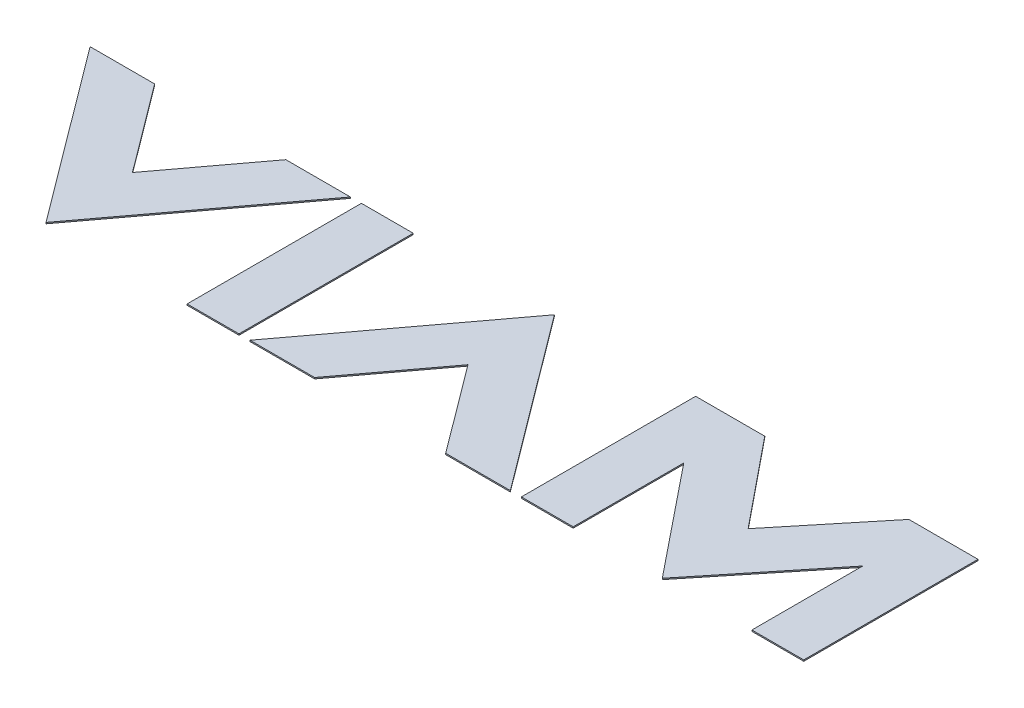
ISO-10303-21;
HEADER;
FILE_DESCRIPTION(('STEP AP214'),'2;1');
FILE_NAME('part.step','',(''),(''),'','','');
FILE_SCHEMA(('AUTOMOTIVE_DESIGN { 1 0 10303 214 1 1 1 1 }'));
ENDSEC;
DATA;
#1=APPLICATION_CONTEXT('core data for automotive mechanical design processes');
#2=APPLICATION_PROTOCOL_DEFINITION('international standard','automotive_design',2000,#1);
#3=PRODUCT_CONTEXT('',#1,'mechanical');
#4=PRODUCT('Part','Part','',(#3));
#5=PRODUCT_RELATED_PRODUCT_CATEGORY('part','',(#4));
#6=PRODUCT_DEFINITION_FORMATION('','',#4);
#7=PRODUCT_DEFINITION_CONTEXT('part definition',#1,'design');
#8=PRODUCT_DEFINITION('design','',#6,#7);
#9=PRODUCT_DEFINITION_SHAPE('','',#8);
#10=(LENGTH_UNIT() NAMED_UNIT(*) SI_UNIT(.MILLI.,.METRE.));
#11=(NAMED_UNIT(*) PLANE_ANGLE_UNIT() SI_UNIT($,.RADIAN.));
#12=(NAMED_UNIT(*) SI_UNIT($,.STERADIAN.) SOLID_ANGLE_UNIT());
#13=UNCERTAINTY_MEASURE_WITH_UNIT(LENGTH_MEASURE(1.E-05),#10,'distance_accuracy_value','');
#14=(GEOMETRIC_REPRESENTATION_CONTEXT(3) GLOBAL_UNCERTAINTY_ASSIGNED_CONTEXT((#13)) GLOBAL_UNIT_ASSIGNED_CONTEXT((#10,
#11,#12)) REPRESENTATION_CONTEXT('',''));
#15=CARTESIAN_POINT('',(0.,0.,0.));
#16=DIRECTION('',(0.,0.,1.));
#17=DIRECTION('',(1.,0.,0.));
#18=AXIS2_PLACEMENT_3D('',#15,#16,#17);
#19=CARTESIAN_POINT('',(11.7883153656796,0.1,6.73885035664306));
#20=DIRECTION('',(-0.801244842844147,0.,0.598336612464638));
#21=DIRECTION('',(0.598336612464638,0.,0.801244842844147));
#22=AXIS2_PLACEMENT_3D('',#19,#20,#21);
#23=PLANE('',#22);
#24=DIRECTION('',(-0.598336612464638,0.,-0.801244842844147));
#25=VECTOR('',#24,1.);
#26=CARTESIAN_POINT('',(11.7883153656796,0.,6.73885035664306));
#27=LINE('',#26,#25);
#28=CARTESIAN_POINT('',(11.7883153656796,0.,6.73885035664306));
#29=VERTEX_POINT('',#28);
#30=CARTESIAN_POINT('',(1.31660656567958,0.,-7.28402990335696));
#31=VERTEX_POINT('',#30);
#32=EDGE_CURVE('E150',#29,#31,#27,.T.);
#33=ORIENTED_EDGE('',*,*,#32,.T.);
#34=DIRECTION('',(0.,-1.,0.));
#35=VECTOR('',#34,1.);
#36=CARTESIAN_POINT('',(1.31660656567958,0.1,-7.28402990335696));
#37=LINE('',#36,#35);
#38=CARTESIAN_POINT('',(1.31660656567958,0.1,-7.28402990335696));
#39=VERTEX_POINT('',#38);
#40=EDGE_CURVE('E12',#39,#31,#37,.T.);
#41=ORIENTED_EDGE('',*,*,#40,.F.);
#42=DIRECTION('',(-0.598336612464638,0.,-0.801244842844147));
#43=VECTOR('',#42,1.);
#44=CARTESIAN_POINT('',(11.7883153656796,0.1,6.73885035664306));
#45=LINE('',#44,#43);
#46=CARTESIAN_POINT('',(11.7883153656796,0.1,6.73885035664306));
#47=VERTEX_POINT('',#46);
#48=EDGE_CURVE('E165',#47,#39,#45,.T.);
#49=ORIENTED_EDGE('',*,*,#48,.F.);
#50=DIRECTION('',(0.,-1.,0.));
#51=VECTOR('',#50,1.);
#52=CARTESIAN_POINT('',(11.7883153656796,0.1,6.73885035664306));
#53=LINE('',#52,#51);
#54=EDGE_CURVE('E146',#47,#29,#53,.T.);
#55=ORIENTED_EDGE('',*,*,#54,.T.);
#56=EDGE_LOOP('',(#33,#41,#49,#55));
#57=FACE_BOUND('',#56,.T.);
#58=ADVANCED_FACE('F50',(#57),#23,.F.);
#59=CARTESIAN_POINT('',(1.31660656567958,0.1,-7.28402990335696));
#60=DIRECTION('',(0.801160335078263,0.,0.598449761882553));
#61=DIRECTION('',(0.598449761882553,0.,-0.801160335078263));
#62=AXIS2_PLACEMENT_3D('',#59,#60,#61);
#63=PLANE('',#62);
#64=DIRECTION('',(-0.598449761882553,0.,0.801160335078263));
#65=VECTOR('',#64,1.);
#66=CARTESIAN_POINT('',(1.31660656567958,0.,-7.28402990335696));
#67=LINE('',#66,#65);
#68=CARTESIAN_POINT('',(-9.15510223432043,0.,6.73472031664306));
#69=VERTEX_POINT('',#68);
#70=EDGE_CURVE('E154',#31,#69,#67,.T.);
#71=ORIENTED_EDGE('',*,*,#70,.T.);
#72=DIRECTION('',(0.,-1.,0.));
#73=VECTOR('',#72,1.);
#74=CARTESIAN_POINT('',(-9.15510223432043,0.1,6.73472031664306));
#75=LINE('',#74,#73);
#76=CARTESIAN_POINT('',(-9.15510223432043,0.1,6.73472031664306));
#77=VERTEX_POINT('',#76);
#78=EDGE_CURVE('E59',#77,#69,#75,.T.);
#79=ORIENTED_EDGE('',*,*,#78,.F.);
#80=DIRECTION('',(-0.598449761882553,0.,0.801160335078263));
#81=VECTOR('',#80,1.);
#82=CARTESIAN_POINT('',(1.31660656567958,0.1,-7.28402990335696));
#83=LINE('',#82,#81);
#84=EDGE_CURVE('E111',#39,#77,#83,.T.);
#85=ORIENTED_EDGE('',*,*,#84,.F.);
#86=ORIENTED_EDGE('',*,*,#40,.T.);
#87=EDGE_LOOP('',(#71,#79,#85,#86));
#88=FACE_BOUND('',#87,.T.);
#89=ADVANCED_FACE('F193',(#88),#63,.F.);
#90=CARTESIAN_POINT('',(-9.15510223432043,0.1,6.73472031664306));
#91=DIRECTION('',(0.,0.,-1.));
#92=DIRECTION('',(-1.,0.,0.));
#93=AXIS2_PLACEMENT_3D('',#90,#91,#92);
#94=PLANE('',#93);
#95=DIRECTION('',(1.,0.,0.));
#96=VECTOR('',#95,1.);
#97=CARTESIAN_POINT('',(-9.15510223432043,0.,6.73472031664306));
#98=LINE('',#97,#96);
#99=CARTESIAN_POINT('',(-3.95856703432044,0.,6.73472031664306));
#100=VERTEX_POINT('',#99);
#101=EDGE_CURVE('E156',#69,#100,#98,.T.);
#102=ORIENTED_EDGE('',*,*,#101,.T.);
#103=DIRECTION('',(0.,-1.,0.));
#104=VECTOR('',#103,1.);
#105=CARTESIAN_POINT('',(-3.95856703432044,0.1,6.73472031664306));
#106=LINE('',#105,#104);
#107=CARTESIAN_POINT('',(-3.95856703432044,0.1,6.73472031664306));
#108=VERTEX_POINT('',#107);
#109=EDGE_CURVE('E138',#108,#100,#106,.T.);
#110=ORIENTED_EDGE('',*,*,#109,.F.);
#111=DIRECTION('',(1.,0.,0.));
#112=VECTOR('',#111,1.);
#113=CARTESIAN_POINT('',(-9.15510223432043,0.1,6.73472031664306));
#114=LINE('',#113,#112);
#115=EDGE_CURVE('E127',#77,#108,#114,.T.);
#116=ORIENTED_EDGE('',*,*,#115,.F.);
#117=ORIENTED_EDGE('',*,*,#78,.T.);
#118=EDGE_LOOP('',(#102,#110,#116,#117));
#119=FACE_BOUND('',#118,.T.);
#120=ADVANCED_FACE('F175',(#119),#94,.F.);
#121=CARTESIAN_POINT('',(-3.95856703432044,0.1,6.73472031664306));
#122=DIRECTION('',(-0.801122457843259,0.,-0.598500465780249));
#123=DIRECTION('',(-0.598500465780249,0.,0.801122457843259));
#124=AXIS2_PLACEMENT_3D('',#121,#122,#123);
#125=PLANE('',#124);
#126=DIRECTION('',(0.598500465780249,0.,-0.801122457843259));
#127=VECTOR('',#126,1.);
#128=CARTESIAN_POINT('',(-3.95856703432044,0.,6.73472031664306));
#129=LINE('',#128,#127);
#130=CARTESIAN_POINT('',(1.31660656567958,0.,-0.326360303356931));
#131=VERTEX_POINT('',#130);
#132=EDGE_CURVE('E136',#100,#131,#129,.T.);
#133=ORIENTED_EDGE('',*,*,#132,.T.);
#134=DIRECTION('',(0.,-1.,0.));
#135=VECTOR('',#134,1.);
#136=CARTESIAN_POINT('',(1.31660656567958,0.1,-0.326360303356931));
#137=LINE('',#136,#135);
#138=CARTESIAN_POINT('',(1.31660656567958,0.1,-0.326360303356931));
#139=VERTEX_POINT('',#138);
#140=EDGE_CURVE('E133',#139,#131,#137,.T.);
#141=ORIENTED_EDGE('',*,*,#140,.F.);
#142=DIRECTION('',(0.598500465780249,0.,-0.801122457843259));
#143=VECTOR('',#142,1.);
#144=CARTESIAN_POINT('',(-3.95856703432044,0.1,6.73472031664306));
#145=LINE('',#144,#143);
#146=EDGE_CURVE('E121',#108,#139,#145,.T.);
#147=ORIENTED_EDGE('',*,*,#146,.F.);
#148=ORIENTED_EDGE('',*,*,#109,.T.);
#149=EDGE_LOOP('',(#133,#141,#147,#148));
#150=FACE_BOUND('',#149,.T.);
#151=ADVANCED_FACE('F134',(#150),#125,.F.);
#152=CARTESIAN_POINT('',(1.31660656567958,0.1,-0.326360303356931));
#153=DIRECTION('',(0.801290209366539,0.,-0.598275856418532));
#154=DIRECTION('',(-0.598275856418532,0.,-0.801290209366539));
#155=AXIS2_PLACEMENT_3D('',#152,#153,#154);
#156=PLANE('',#155);
#157=DIRECTION('',(0.598275856418532,0.,0.801290209366539));
#158=VECTOR('',#157,1.);
#159=CARTESIAN_POINT('',(1.31660656567958,0.,-0.326360303356931));
#160=LINE('',#159,#158);
#161=CARTESIAN_POINT('',(6.59178016567957,0.,6.73885035664306));
#162=VERTEX_POINT('',#161);
#163=EDGE_CURVE('E97',#131,#162,#160,.T.);
#164=ORIENTED_EDGE('',*,*,#163,.T.);
#165=DIRECTION('',(0.,-1.,0.));
#166=VECTOR('',#165,1.);
#167=CARTESIAN_POINT('',(6.59178016567957,0.1,6.73885035664306));
#168=LINE('',#167,#166);
#169=CARTESIAN_POINT('',(6.59178016567957,0.1,6.73885035664306));
#170=VERTEX_POINT('',#169);
#171=EDGE_CURVE('E139',#170,#162,#168,.T.);
#172=ORIENTED_EDGE('',*,*,#171,.F.);
#173=DIRECTION('',(0.598275856418532,0.,0.801290209366539));
#174=VECTOR('',#173,1.);
#175=CARTESIAN_POINT('',(1.31660656567958,0.1,-0.326360303356931));
#176=LINE('',#175,#174);
#177=EDGE_CURVE('E125',#139,#170,#176,.T.);
#178=ORIENTED_EDGE('',*,*,#177,.F.);
#179=ORIENTED_EDGE('',*,*,#140,.T.);
#180=EDGE_LOOP('',(#164,#172,#178,#179));
#181=FACE_BOUND('',#180,.T.);
#182=ADVANCED_FACE('F141',(#181),#156,.F.);
#183=CARTESIAN_POINT('',(6.59178016567957,0.1,6.73885035664306));
#184=DIRECTION('',(0.,0.,-1.));
#185=DIRECTION('',(-1.,0.,0.));
#186=AXIS2_PLACEMENT_3D('',#183,#184,#185);
#187=PLANE('',#186);
#188=DIRECTION('',(1.,0.,0.));
#189=VECTOR('',#188,1.);
#190=CARTESIAN_POINT('',(6.59178016567957,0.,6.73885035664306));
#191=LINE('',#190,#189);
#192=EDGE_CURVE('E103',#162,#29,#191,.T.);
#193=ORIENTED_EDGE('',*,*,#192,.T.);
#194=ORIENTED_EDGE('',*,*,#54,.F.);
#195=DIRECTION('',(1.,0.,0.));
#196=VECTOR('',#195,1.);
#197=CARTESIAN_POINT('',(6.59178016567957,0.1,6.73885035664306));
#198=LINE('',#197,#196);
#199=EDGE_CURVE('E67',#170,#47,#198,.T.);
#200=ORIENTED_EDGE('',*,*,#199,.F.);
#201=ORIENTED_EDGE('',*,*,#171,.T.);
#202=EDGE_LOOP('',(#193,#194,#200,#201));
#203=FACE_BOUND('',#202,.T.);
#204=ADVANCED_FACE('F182',(#203),#187,.F.);
#205=CARTESIAN_POINT('',(0.,0.1,0.));
#206=DIRECTION('',(0.,-1.,0.));
#207=DIRECTION('',(0.,0.,-1.));
#208=AXIS2_PLACEMENT_3D('',#205,#206,#207);
#209=PLANE('',#208);
#210=ORIENTED_EDGE('',*,*,#48,.T.);
#211=ORIENTED_EDGE('',*,*,#84,.T.);
#212=ORIENTED_EDGE('',*,*,#115,.T.);
#213=ORIENTED_EDGE('',*,*,#146,.T.);
#214=ORIENTED_EDGE('',*,*,#177,.T.);
#215=ORIENTED_EDGE('',*,*,#199,.T.);
#216=EDGE_LOOP('',(#210,#211,#212,#213,#214,#215));
#217=FACE_BOUND('',#216,.T.);
#218=ADVANCED_FACE('F123',(#217),#209,.F.);
#219=CARTESIAN_POINT('',(0.,0.,0.));
#220=DIRECTION('',(0.,-1.,0.));
#221=DIRECTION('',(0.,0.,-1.));
#222=AXIS2_PLACEMENT_3D('',#219,#220,#221);
#223=PLANE('',#222);
#224=ORIENTED_EDGE('',*,*,#32,.F.);
#225=ORIENTED_EDGE('',*,*,#192,.F.);
#226=ORIENTED_EDGE('',*,*,#163,.F.);
#227=ORIENTED_EDGE('',*,*,#132,.F.);
#228=ORIENTED_EDGE('',*,*,#101,.F.);
#229=ORIENTED_EDGE('',*,*,#70,.F.);
#230=EDGE_LOOP('',(#224,#225,#226,#227,#228,#229));
#231=FACE_BOUND('',#230,.T.);
#232=ADVANCED_FACE('F178',(#231),#223,.T.);
#233=CLOSED_SHELL('',(#58,#89,#120,#151,#182,#204,#218,#232));
#234=MANIFOLD_SOLID_BREP('B2',#233);
#235=CARTESIAN_POINT('',(-15.0999214343204,0.1,-7.28402990335696));
#236=DIRECTION('',(0.,0.,1.));
#237=DIRECTION('',(1.,0.,0.));
#238=AXIS2_PLACEMENT_3D('',#235,#236,#237);
#239=PLANE('',#238);
#240=DIRECTION('',(-1.,0.,0.));
#241=VECTOR('',#240,1.);
#242=CARTESIAN_POINT('',(-15.0999214343204,0.,-7.28402990335696));
#243=LINE('',#242,#241);
#244=CARTESIAN_POINT('',(-15.0999214343204,0.,-7.28402990335696));
#245=VERTEX_POINT('',#244);
#246=CARTESIAN_POINT('',(-20.2966090343204,0.,-7.28402990335696));
#247=VERTEX_POINT('',#246);
#248=EDGE_CURVE('E350',#245,#247,#243,.T.);
#249=ORIENTED_EDGE('',*,*,#248,.T.);
#250=DIRECTION('',(0.,-1.,0.));
#251=VECTOR('',#250,1.);
#252=CARTESIAN_POINT('',(-20.2966090343204,0.1,-7.28402990335696));
#253=LINE('',#252,#251);
#254=CARTESIAN_POINT('',(-20.2966090343204,0.1,-7.28402990335696));
#255=VERTEX_POINT('',#254);
#256=EDGE_CURVE('E48',#255,#247,#253,.T.);
#257=ORIENTED_EDGE('',*,*,#256,.F.);
#258=DIRECTION('',(-1.,0.,0.));
#259=VECTOR('',#258,1.);
#260=CARTESIAN_POINT('',(-15.0999214343204,0.1,-7.28402990335696));
#261=LINE('',#260,#259);
#262=CARTESIAN_POINT('',(-15.0999214343204,0.1,-7.28402990335696));
#263=VERTEX_POINT('',#262);
#264=EDGE_CURVE('E360',#263,#255,#261,.T.);
#265=ORIENTED_EDGE('',*,*,#264,.F.);
#266=DIRECTION('',(0.,-1.,0.));
#267=VECTOR('',#266,1.);
#268=CARTESIAN_POINT('',(-15.0999214343204,0.1,-7.28402990335696));
#269=LINE('',#268,#267);
#270=EDGE_CURVE('E346',#263,#245,#269,.T.);
#271=ORIENTED_EDGE('',*,*,#270,.T.);
#272=EDGE_LOOP('',(#249,#257,#265,#271));
#273=FACE_BOUND('',#272,.T.);
#274=ADVANCED_FACE('F266',(#273),#239,.F.);
#275=CARTESIAN_POINT('',(-20.2966090343204,0.1,-7.28402990335696));
#276=DIRECTION('',(0.80129342434951,0.,0.598271550463697));
#277=DIRECTION('',(0.598271550463697,0.,-0.80129342434951));
#278=AXIS2_PLACEMENT_3D('',#275,#276,#277);
#279=PLANE('',#278);
#280=DIRECTION('',(-0.598271550463697,0.,0.80129342434951));
#281=VECTOR('',#280,1.);
#282=CARTESIAN_POINT('',(-20.2966090343204,0.,-7.28402990335696));
#283=LINE('',#282,#281);
#284=CARTESIAN_POINT('',(-25.5717064343204,0.,-0.218842103356952));
#285=VERTEX_POINT('',#284);
#286=EDGE_CURVE('E353',#247,#285,#283,.T.);
#287=ORIENTED_EDGE('',*,*,#286,.T.);
#288=DIRECTION('',(0.,-1.,0.));
#289=VECTOR('',#288,1.);
#290=CARTESIAN_POINT('',(-25.5717064343204,0.1,-0.218842103356952));
#291=LINE('',#290,#289);
#292=CARTESIAN_POINT('',(-25.5717064343204,0.1,-0.218842103356952));
#293=VERTEX_POINT('',#292);
#294=EDGE_CURVE('E274',#293,#285,#291,.T.);
#295=ORIENTED_EDGE('',*,*,#294,.F.);
#296=DIRECTION('',(-0.598271550463697,0.,0.80129342434951));
#297=VECTOR('',#296,1.);
#298=CARTESIAN_POINT('',(-20.2966090343204,0.1,-7.28402990335696));
#299=LINE('',#298,#297);
#300=EDGE_CURVE('E319',#255,#293,#299,.T.);
#301=ORIENTED_EDGE('',*,*,#300,.F.);
#302=ORIENTED_EDGE('',*,*,#256,.T.);
#303=EDGE_LOOP('',(#287,#295,#301,#302));
#304=FACE_BOUND('',#303,.T.);
#305=ADVANCED_FACE('F384',(#304),#279,.F.);
#306=CARTESIAN_POINT('',(-25.5717064343204,0.1,-0.218842103356952));
#307=DIRECTION('',(-0.801292181455901,0.,0.59827321512637));
#308=DIRECTION('',(0.59827321512637,0.,0.801292181455901));
#309=AXIS2_PLACEMENT_3D('',#306,#307,#308);
#310=PLANE('',#309);
#311=DIRECTION('',(-0.59827321512637,0.,-0.801292181455901));
#312=VECTOR('',#311,1.);
#313=CARTESIAN_POINT('',(-25.5717064343204,0.,-0.218842103356952));
#314=LINE('',#313,#312);
#315=CARTESIAN_POINT('',(-30.8468266943204,0.,-7.28402990335696));
#316=VERTEX_POINT('',#315);
#317=EDGE_CURVE('E355',#285,#316,#314,.T.);
#318=ORIENTED_EDGE('',*,*,#317,.T.);
#319=DIRECTION('',(0.,-1.,0.));
#320=VECTOR('',#319,1.);
#321=CARTESIAN_POINT('',(-30.8468266943204,0.1,-7.28402990335696));
#322=LINE('',#321,#320);
#323=CARTESIAN_POINT('',(-30.8468266943204,0.1,-7.28402990335696));
#324=VERTEX_POINT('',#323);
#325=EDGE_CURVE('E341',#324,#316,#322,.T.);
#326=ORIENTED_EDGE('',*,*,#325,.F.);
#327=DIRECTION('',(-0.59827321512637,0.,-0.801292181455901));
#328=VECTOR('',#327,1.);
#329=CARTESIAN_POINT('',(-25.5717064343204,0.1,-0.218842103356952));
#330=LINE('',#329,#328);
#331=EDGE_CURVE('E332',#293,#324,#330,.T.);
#332=ORIENTED_EDGE('',*,*,#331,.F.);
#333=ORIENTED_EDGE('',*,*,#294,.T.);
#334=EDGE_LOOP('',(#318,#326,#332,#333));
#335=FACE_BOUND('',#334,.T.);
#336=ADVANCED_FACE('F366',(#335),#310,.F.);
#337=CARTESIAN_POINT('',(-30.8468266943204,0.1,-7.28402990335696));
#338=DIRECTION('',(0.,0.,1.));
#339=DIRECTION('',(1.,0.,0.));
#340=AXIS2_PLACEMENT_3D('',#337,#338,#339);
#341=PLANE('',#340);
#342=DIRECTION('',(-1.,0.,0.));
#343=VECTOR('',#342,1.);
#344=CARTESIAN_POINT('',(-30.8468266943204,0.,-7.28402990335696));
#345=LINE('',#344,#343);
#346=CARTESIAN_POINT('',(-36.0434152343204,0.,-7.28402990335696));
#347=VERTEX_POINT('',#346);
#348=EDGE_CURVE('E340',#316,#347,#345,.T.);
#349=ORIENTED_EDGE('',*,*,#348,.T.);
#350=DIRECTION('',(0.,-1.,0.));
#351=VECTOR('',#350,1.);
#352=CARTESIAN_POINT('',(-36.0434152343204,0.1,-7.28402990335696));
#353=LINE('',#352,#351);
#354=CARTESIAN_POINT('',(-36.0434152343204,0.1,-7.28402990335696));
#355=VERTEX_POINT('',#354);
#356=EDGE_CURVE('E337',#355,#347,#353,.T.);
#357=ORIENTED_EDGE('',*,*,#356,.F.);
#358=DIRECTION('',(-1.,0.,0.));
#359=VECTOR('',#358,1.);
#360=CARTESIAN_POINT('',(-30.8468266943204,0.1,-7.28402990335696));
#361=LINE('',#360,#359);
#362=EDGE_CURVE('E326',#324,#355,#361,.T.);
#363=ORIENTED_EDGE('',*,*,#362,.F.);
#364=ORIENTED_EDGE('',*,*,#325,.T.);
#365=EDGE_LOOP('',(#349,#357,#363,#364));
#366=FACE_BOUND('',#365,.T.);
#367=ADVANCED_FACE('F338',(#366),#341,.F.);
#368=CARTESIAN_POINT('',(-36.0434152343204,0.1,-7.28402990335696));
#369=DIRECTION('',(0.801160335078263,0.,-0.598449761882553));
#370=DIRECTION('',(-0.598449761882553,0.,-0.801160335078263));
#371=AXIS2_PLACEMENT_3D('',#368,#369,#370);
#372=PLANE('',#371);
#373=DIRECTION('',(0.598449761882553,0.,0.801160335078263));
#374=VECTOR('',#373,1.);
#375=CARTESIAN_POINT('',(-36.0434152343204,0.,-7.28402990335696));
#376=LINE('',#375,#374);
#377=CARTESIAN_POINT('',(-25.5717064343204,0.,6.73472031664306));
#378=VERTEX_POINT('',#377);
#379=EDGE_CURVE('E305',#347,#378,#376,.T.);
#380=ORIENTED_EDGE('',*,*,#379,.T.);
#381=DIRECTION('',(0.,-1.,0.));
#382=VECTOR('',#381,1.);
#383=CARTESIAN_POINT('',(-25.5717064343204,0.1,6.73472031664306));
#384=LINE('',#383,#382);
#385=CARTESIAN_POINT('',(-25.5717064343204,0.1,6.73472031664306));
#386=VERTEX_POINT('',#385);
#387=EDGE_CURVE('E342',#386,#378,#384,.T.);
#388=ORIENTED_EDGE('',*,*,#387,.F.);
#389=DIRECTION('',(0.598449761882553,0.,0.801160335078263));
#390=VECTOR('',#389,1.);
#391=CARTESIAN_POINT('',(-36.0434152343204,0.1,-7.28402990335696));
#392=LINE('',#391,#390);
#393=EDGE_CURVE('E330',#355,#386,#392,.T.);
#394=ORIENTED_EDGE('',*,*,#393,.F.);
#395=ORIENTED_EDGE('',*,*,#356,.T.);
#396=EDGE_LOOP('',(#380,#388,#394,#395));
#397=FACE_BOUND('',#396,.T.);
#398=ADVANCED_FACE('F344',(#397),#372,.F.);
#399=CARTESIAN_POINT('',(-25.5717064343204,0.1,6.73472031664306));
#400=DIRECTION('',(-0.801158247166537,0.,-0.598452557014374));
#401=DIRECTION('',(-0.598452557014374,0.,0.801158247166537));
#402=AXIS2_PLACEMENT_3D('',#399,#400,#401);
#403=PLANE('',#402);
#404=DIRECTION('',(0.598452557014374,0.,-0.801158247166537));
#405=VECTOR('',#404,1.);
#406=CARTESIAN_POINT('',(-25.5717064343204,0.,6.73472031664306));
#407=LINE('',#406,#405);
#408=EDGE_CURVE('E311',#378,#245,#407,.T.);
#409=ORIENTED_EDGE('',*,*,#408,.T.);
#410=ORIENTED_EDGE('',*,*,#270,.F.);
#411=DIRECTION('',(0.598452557014374,0.,-0.801158247166537));
#412=VECTOR('',#411,1.);
#413=CARTESIAN_POINT('',(-25.5717064343204,0.1,6.73472031664306));
#414=LINE('',#413,#412);
#415=EDGE_CURVE('E282',#386,#263,#414,.T.);
#416=ORIENTED_EDGE('',*,*,#415,.F.);
#417=ORIENTED_EDGE('',*,*,#387,.T.);
#418=EDGE_LOOP('',(#409,#410,#416,#417));
#419=FACE_BOUND('',#418,.T.);
#420=ADVANCED_FACE('F373',(#419),#403,.F.);
#421=CARTESIAN_POINT('',(0.,0.1,0.));
#422=DIRECTION('',(0.,1.,0.));
#423=DIRECTION('',(0.,0.,1.));
#424=AXIS2_PLACEMENT_3D('',#421,#422,#423);
#425=PLANE('',#424);
#426=ORIENTED_EDGE('',*,*,#264,.T.);
#427=ORIENTED_EDGE('',*,*,#300,.T.);
#428=ORIENTED_EDGE('',*,*,#331,.T.);
#429=ORIENTED_EDGE('',*,*,#362,.T.);
#430=ORIENTED_EDGE('',*,*,#393,.T.);
#431=ORIENTED_EDGE('',*,*,#415,.T.);
#432=EDGE_LOOP('',(#426,#427,#428,#429,#430,#431));
#433=FACE_BOUND('',#432,.T.);
#434=ADVANCED_FACE('F328',(#433),#425,.T.);
#435=CARTESIAN_POINT('',(0.,0.,0.));
#436=DIRECTION('',(0.,1.,0.));
#437=DIRECTION('',(0.,0.,1.));
#438=AXIS2_PLACEMENT_3D('',#435,#436,#437);
#439=PLANE('',#438);
#440=ORIENTED_EDGE('',*,*,#248,.F.);
#441=ORIENTED_EDGE('',*,*,#408,.F.);
#442=ORIENTED_EDGE('',*,*,#379,.F.);
#443=ORIENTED_EDGE('',*,*,#348,.F.);
#444=ORIENTED_EDGE('',*,*,#317,.F.);
#445=ORIENTED_EDGE('',*,*,#286,.F.);
#446=EDGE_LOOP('',(#440,#441,#442,#443,#444,#445));
#447=FACE_BOUND('',#446,.T.);
#448=ADVANCED_FACE('F369',(#447),#439,.F.);
#449=CLOSED_SHELL('',(#274,#305,#336,#367,#398,#420,#434,#448));
#450=MANIFOLD_SOLID_BREP('B6',#449);
#451=CARTESIAN_POINT('',(35.3940847656796,0.1,-7.28402990335696));
#452=DIRECTION('',(0.,0.,1.));
#453=DIRECTION('',(1.,0.,0.));
#454=AXIS2_PLACEMENT_3D('',#451,#452,#453);
#455=PLANE('',#454);
#456=DIRECTION('',(-1.,0.,0.));
#457=VECTOR('',#456,1.);
#458=CARTESIAN_POINT('',(35.3940847656796,0.,-7.28402990335696));
#459=LINE('',#458,#457);
#460=CARTESIAN_POINT('',(35.3940847656796,0.,-7.28402990335696));
#461=VERTEX_POINT('',#460);
#462=CARTESIAN_POINT('',(29.8336945656796,0.,-7.28402990335696));
#463=VERTEX_POINT('',#462);
#464=EDGE_CURVE('E594',#461,#463,#459,.T.);
#465=ORIENTED_EDGE('',*,*,#464,.T.);
#466=DIRECTION('',(0.,-1.,0.));
#467=VECTOR('',#466,1.);
#468=CARTESIAN_POINT('',(29.8336945656796,0.1,-7.28402990335696));
#469=LINE('',#468,#467);
#470=CARTESIAN_POINT('',(29.8336945656796,0.1,-7.28402990335696));
#471=VERTEX_POINT('',#470);
#472=EDGE_CURVE('E264',#471,#463,#469,.T.);
#473=ORIENTED_EDGE('',*,*,#472,.F.);
#474=DIRECTION('',(-1.,0.,0.));
#475=VECTOR('',#474,1.);
#476=CARTESIAN_POINT('',(35.3940847656796,0.1,-7.28402990335696));
#477=LINE('',#476,#475);
#478=CARTESIAN_POINT('',(35.3940847656796,0.1,-7.28402990335696));
#479=VERTEX_POINT('',#478);
#480=EDGE_CURVE('E625',#479,#471,#477,.T.);
#481=ORIENTED_EDGE('',*,*,#480,.F.);
#482=DIRECTION('',(0.,-1.,0.));
#483=VECTOR('',#482,1.);
#484=CARTESIAN_POINT('',(35.3940847656796,0.1,-7.28402990335696));
#485=LINE('',#484,#483);
#486=EDGE_CURVE('E590',#479,#461,#485,.T.);
#487=ORIENTED_EDGE('',*,*,#486,.T.);
#488=EDGE_LOOP('',(#465,#473,#481,#487));
#489=FACE_BOUND('',#488,.T.);
#490=ADVANCED_FACE('F451',(#489),#455,.F.);
#491=CARTESIAN_POINT('',(29.8336945656796,0.1,-7.28402990335696));
#492=DIRECTION('',(0.773976134550616,0.,0.633214768578629));
#493=DIRECTION('',(0.633214768578629,0.,-0.773976134550616));
#494=AXIS2_PLACEMENT_3D('',#491,#492,#493);
#495=PLANE('',#494);
#496=DIRECTION('',(-0.633214768578629,0.,0.773976134550616));
#497=VECTOR('',#496,1.);
#498=CARTESIAN_POINT('',(29.8336945656796,0.,-7.28402990335696));
#499=LINE('',#498,#497);
#500=CARTESIAN_POINT('',(24.0128527656796,0.,-0.169235903356935));
#501=VERTEX_POINT('',#500);
#502=EDGE_CURVE('E598',#463,#501,#499,.T.);
#503=ORIENTED_EDGE('',*,*,#502,.T.);
#504=DIRECTION('',(0.,-1.,0.));
#505=VECTOR('',#504,1.);
#506=CARTESIAN_POINT('',(24.0128527656796,0.1,-0.169235903356935));
#507=LINE('',#506,#505);
#508=CARTESIAN_POINT('',(24.0128527656796,0.1,-0.169235903356935));
#509=VERTEX_POINT('',#508);
#510=EDGE_CURVE('E460',#509,#501,#507,.T.);
#511=ORIENTED_EDGE('',*,*,#510,.F.);
#512=DIRECTION('',(-0.633214768578629,0.,0.773976134550616));
#513=VECTOR('',#512,1.);
#514=CARTESIAN_POINT('',(29.8336945656796,0.1,-7.28402990335696));
#515=LINE('',#514,#513);
#516=EDGE_CURVE('E535',#471,#509,#515,.T.);
#517=ORIENTED_EDGE('',*,*,#516,.F.);
#518=ORIENTED_EDGE('',*,*,#472,.T.);
#519=EDGE_LOOP('',(#503,#511,#517,#518));
#520=FACE_BOUND('',#519,.T.);
#521=ADVANCED_FACE('F713',(#520),#495,.F.);
#522=CARTESIAN_POINT('',(24.0128527656796,0.1,-0.169235903356935));
#523=DIRECTION('',(-0.776407439323884,0.,0.630231297352432));
#524=DIRECTION('',(0.630231297352432,0.,0.776407439323884));
#525=AXIS2_PLACEMENT_3D('',#522,#523,#524);
#526=PLANE('',#525);
#527=DIRECTION('',(-0.630231297352432,0.,-0.776407439323884));
#528=VECTOR('',#527,1.);
#529=CARTESIAN_POINT('',(24.0128527656796,0.,-0.169235903356935));
#530=LINE('',#529,#528);
#531=CARTESIAN_POINT('',(18.2375785656796,0.,-7.28402990335696));
#532=VERTEX_POINT('',#531);
#533=EDGE_CURVE('E601',#501,#532,#530,.T.);
#534=ORIENTED_EDGE('',*,*,#533,.T.);
#535=DIRECTION('',(0.,-1.,0.));
#536=VECTOR('',#535,1.);
#537=CARTESIAN_POINT('',(18.2375785656796,0.1,-7.28402990335696));
#538=LINE('',#537,#536);
#539=CARTESIAN_POINT('',(18.2375785656796,0.1,-7.28402990335696));
#540=VERTEX_POINT('',#539);
#541=EDGE_CURVE('E647',#540,#532,#538,.T.);
#542=ORIENTED_EDGE('',*,*,#541,.F.);
#543=DIRECTION('',(-0.630231297352432,0.,-0.776407439323884));
#544=VECTOR('',#543,1.);
#545=CARTESIAN_POINT('',(24.0128527656796,0.1,-0.169235903356935));
#546=LINE('',#545,#544);
#547=EDGE_CURVE('E658',#509,#540,#546,.T.);
#548=ORIENTED_EDGE('',*,*,#547,.F.);
#549=ORIENTED_EDGE('',*,*,#510,.T.);
#550=EDGE_LOOP('',(#534,#542,#548,#549));
#551=FACE_BOUND('',#550,.T.);
#552=ADVANCED_FACE('F656',(#551),#526,.F.);
#553=CARTESIAN_POINT('',(18.2375785656796,0.1,-7.28402990335696));
#554=DIRECTION('',(0.,0.,1.));
#555=DIRECTION('',(1.,0.,0.));
#556=AXIS2_PLACEMENT_3D('',#553,#554,#555);
#557=PLANE('',#556);
#558=DIRECTION('',(-1.,0.,0.));
#559=VECTOR('',#558,1.);
#560=CARTESIAN_POINT('',(18.2375785656796,0.,-7.28402990335696));
#561=LINE('',#560,#559);
#562=CARTESIAN_POINT('',(12.6771883656796,0.,-7.28402990335696));
#563=VERTEX_POINT('',#562);
#564=EDGE_CURVE('E604',#532,#563,#561,.T.);
#565=ORIENTED_EDGE('',*,*,#564,.T.);
#566=DIRECTION('',(0.,-1.,0.));
#567=VECTOR('',#566,1.);
#568=CARTESIAN_POINT('',(12.6771883656796,0.1,-7.28402990335696));
#569=LINE('',#568,#567);
#570=CARTESIAN_POINT('',(12.6771883656796,0.1,-7.28402990335696));
#571=VERTEX_POINT('',#570);
#572=EDGE_CURVE('E644',#571,#563,#569,.T.);
#573=ORIENTED_EDGE('',*,*,#572,.F.);
#574=DIRECTION('',(-1.,0.,0.));
#575=VECTOR('',#574,1.);
#576=CARTESIAN_POINT('',(18.2375785656796,0.1,-7.28402990335696));
#577=LINE('',#576,#575);
#578=EDGE_CURVE('E676',#540,#571,#577,.T.);
#579=ORIENTED_EDGE('',*,*,#578,.F.);
#580=ORIENTED_EDGE('',*,*,#541,.T.);
#581=EDGE_LOOP('',(#565,#573,#579,#580));
#582=FACE_BOUND('',#581,.T.);
#583=ADVANCED_FACE('F667',(#582),#557,.F.);
#584=CARTESIAN_POINT('',(12.6771883656796,0.1,-7.28402990335696));
#585=DIRECTION('',(1.,0.,0.));
#586=DIRECTION('',(0.,0.,-1.));
#587=AXIS2_PLACEMENT_3D('',#584,#585,#586);
#588=PLANE('',#587);
#589=DIRECTION('',(0.,0.,1.));
#590=VECTOR('',#589,1.);
#591=CARTESIAN_POINT('',(12.6771883656796,0.,-7.28402990335696));
#592=LINE('',#591,#590);
#593=CARTESIAN_POINT('',(12.6771883656796,0.,6.73472031664306));
#594=VERTEX_POINT('',#593);
#595=EDGE_CURVE('E607',#563,#594,#592,.T.);
#596=ORIENTED_EDGE('',*,*,#595,.T.);
#597=DIRECTION('',(0.,-1.,0.));
#598=VECTOR('',#597,1.);
#599=CARTESIAN_POINT('',(12.6771883656796,0.1,6.73472031664306));
#600=LINE('',#599,#598);
#601=CARTESIAN_POINT('',(12.6771883656796,0.1,6.73472031664306));
#602=VERTEX_POINT('',#601);
#603=EDGE_CURVE('E641',#602,#594,#600,.T.);
#604=ORIENTED_EDGE('',*,*,#603,.F.);
#605=DIRECTION('',(0.,0.,1.));
#606=VECTOR('',#605,1.);
#607=CARTESIAN_POINT('',(12.6771883656796,0.1,-7.28402990335696));
#608=LINE('',#607,#606);
#609=EDGE_CURVE('E673',#571,#602,#608,.T.);
#610=ORIENTED_EDGE('',*,*,#609,.F.);
#611=ORIENTED_EDGE('',*,*,#572,.T.);
#612=EDGE_LOOP('',(#596,#604,#610,#611));
#613=FACE_BOUND('',#612,.T.);
#614=ADVANCED_FACE('F671',(#613),#588,.F.);
#615=CARTESIAN_POINT('',(12.6771883656796,0.1,6.73472031664306));
#616=DIRECTION('',(0.,0.,-1.));
#617=DIRECTION('',(-1.,0.,0.));
#618=AXIS2_PLACEMENT_3D('',#615,#616,#617);
#619=PLANE('',#618);
#620=DIRECTION('',(1.,0.,0.));
#621=VECTOR('',#620,1.);
#622=CARTESIAN_POINT('',(12.6771883656796,0.,6.73472031664306));
#623=LINE('',#622,#621);
#624=CARTESIAN_POINT('',(16.8443377656796,0.,6.73472031664306));
#625=VERTEX_POINT('',#624);
#626=EDGE_CURVE('E609',#594,#625,#623,.T.);
#627=ORIENTED_EDGE('',*,*,#626,.T.);
#628=DIRECTION('',(0.,-1.,0.));
#629=VECTOR('',#628,1.);
#630=CARTESIAN_POINT('',(16.8443377656796,0.1,6.73472031664306));
#631=LINE('',#630,#629);
#632=CARTESIAN_POINT('',(16.8443377656796,0.1,6.73472031664306));
#633=VERTEX_POINT('',#632);
#634=EDGE_CURVE('E638',#633,#625,#631,.T.);
#635=ORIENTED_EDGE('',*,*,#634,.F.);
#636=DIRECTION('',(1.,0.,0.));
#637=VECTOR('',#636,1.);
#638=CARTESIAN_POINT('',(12.6771883656796,0.1,6.73472031664306));
#639=LINE('',#638,#637);
#640=EDGE_CURVE('E675',#602,#633,#639,.T.);
#641=ORIENTED_EDGE('',*,*,#640,.F.);
#642=ORIENTED_EDGE('',*,*,#603,.T.);
#643=EDGE_LOOP('',(#627,#635,#641,#642));
#644=FACE_BOUND('',#643,.T.);
#645=ADVANCED_FACE('F726',(#644),#619,.F.);
#646=CARTESIAN_POINT('',(16.8443377656796,0.1,6.73472031664306));
#647=DIRECTION('',(-1.,0.,0.));
#648=DIRECTION('',(0.,0.,1.));
#649=AXIS2_PLACEMENT_3D('',#646,#647,#648);
#650=PLANE('',#649);
#651=DIRECTION('',(0.,0.,-1.));
#652=VECTOR('',#651,1.);
#653=CARTESIAN_POINT('',(16.8443377656796,0.,6.73472031664306));
#654=LINE('',#653,#652);
#655=CARTESIAN_POINT('',(16.8443377656796,0.,-2.16186590335696));
#656=VERTEX_POINT('',#655);
#657=EDGE_CURVE('E611',#625,#656,#654,.T.);
#658=ORIENTED_EDGE('',*,*,#657,.T.);
#659=DIRECTION('',(0.,-1.,0.));
#660=VECTOR('',#659,1.);
#661=CARTESIAN_POINT('',(16.8443377656796,0.1,-2.16186590335696));
#662=LINE('',#661,#660);
#663=CARTESIAN_POINT('',(16.8443377656796,0.1,-2.16186590335696));
#664=VERTEX_POINT('',#663);
#665=EDGE_CURVE('E634',#664,#656,#662,.T.);
#666=ORIENTED_EDGE('',*,*,#665,.F.);
#667=DIRECTION('',(0.,0.,-1.));
#668=VECTOR('',#667,1.);
#669=CARTESIAN_POINT('',(16.8443377656796,0.1,6.73472031664306));
#670=LINE('',#669,#668);
#671=EDGE_CURVE('E678',#633,#664,#670,.T.);
#672=ORIENTED_EDGE('',*,*,#671,.F.);
#673=ORIENTED_EDGE('',*,*,#634,.T.);
#674=EDGE_LOOP('',(#658,#666,#672,#673));
#675=FACE_BOUND('',#674,.T.);
#676=ADVANCED_FACE('F729',(#675),#650,.F.);
#677=CARTESIAN_POINT('',(16.8443377656796,0.1,-2.16186590335696));
#678=DIRECTION('',(0.778676058069398,0.,-0.627426168237748));
#679=DIRECTION('',(-0.627426168237748,0.,-0.778676058069398));
#680=AXIS2_PLACEMENT_3D('',#677,#678,#679);
#681=PLANE('',#680);
#682=DIRECTION('',(0.627426168237748,0.,0.778676058069398));
#683=VECTOR('',#682,1.);
#684=CARTESIAN_POINT('',(16.8443377656796,0.,-2.16186590335696));
#685=LINE('',#684,#683);
#686=CARTESIAN_POINT('',(24.0128527656796,0.,6.73472031664306));
#687=VERTEX_POINT('',#686);
#688=EDGE_CURVE('E614',#656,#687,#685,.T.);
#689=ORIENTED_EDGE('',*,*,#688,.T.);
#690=DIRECTION('',(0.,-1.,0.));
#691=VECTOR('',#690,1.);
#692=CARTESIAN_POINT('',(24.0128527656796,0.1,6.73472031664306));
#693=LINE('',#692,#691);
#694=CARTESIAN_POINT('',(24.0128527656796,0.1,6.73472031664306));
#695=VERTEX_POINT('',#694);
#696=EDGE_CURVE('E630',#695,#687,#693,.T.);
#697=ORIENTED_EDGE('',*,*,#696,.F.);
#698=DIRECTION('',(0.627426168237748,0.,0.778676058069398));
#699=VECTOR('',#698,1.);
#700=CARTESIAN_POINT('',(16.8443377656796,0.1,-2.16186590335696));
#701=LINE('',#700,#699);
#702=EDGE_CURVE('E686',#664,#695,#701,.T.);
#703=ORIENTED_EDGE('',*,*,#702,.F.);
#704=ORIENTED_EDGE('',*,*,#665,.T.);
#705=EDGE_LOOP('',(#689,#697,#703,#704));
#706=FACE_BOUND('',#705,.T.);
#707=ADVANCED_FACE('F694',(#706),#681,.F.);
#708=CARTESIAN_POINT('',(24.0128527656796,0.1,6.73472031664306));
#709=DIRECTION('',(-0.777623653734688,0.,-0.62873003201081));
#710=DIRECTION('',(-0.62873003201081,0.,0.777623653734688));
#711=AXIS2_PLACEMENT_3D('',#708,#709,#710);
#712=PLANE('',#711);
#713=DIRECTION('',(0.62873003201081,0.,-0.777623653734688));
#714=VECTOR('',#713,1.);
#715=CARTESIAN_POINT('',(24.0128527656796,0.,6.73472031664306));
#716=LINE('',#715,#714);
#717=CARTESIAN_POINT('',(31.2227443656796,0.,-2.18259230335694));
#718=VERTEX_POINT('',#717);
#719=EDGE_CURVE('E617',#687,#718,#716,.T.);
#720=ORIENTED_EDGE('',*,*,#719,.T.);
#721=DIRECTION('',(0.,-1.,0.));
#722=VECTOR('',#721,1.);
#723=CARTESIAN_POINT('',(31.2227443656796,0.1,-2.18259230335694));
#724=LINE('',#723,#722);
#725=CARTESIAN_POINT('',(31.2227443656796,0.1,-2.18259230335694));
#726=VERTEX_POINT('',#725);
#727=EDGE_CURVE('E581',#726,#718,#724,.T.);
#728=ORIENTED_EDGE('',*,*,#727,.F.);
#729=DIRECTION('',(0.62873003201081,0.,-0.777623653734688));
#730=VECTOR('',#729,1.);
#731=CARTESIAN_POINT('',(24.0128527656796,0.1,6.73472031664306));
#732=LINE('',#731,#730);
#733=EDGE_CURVE('E570',#695,#726,#732,.T.);
#734=ORIENTED_EDGE('',*,*,#733,.F.);
#735=ORIENTED_EDGE('',*,*,#696,.T.);
#736=EDGE_LOOP('',(#720,#728,#734,#735));
#737=FACE_BOUND('',#736,.T.);
#738=ADVANCED_FACE('F698',(#737),#712,.F.);
#739=CARTESIAN_POINT('',(31.2227443656796,0.1,-2.18259230335694));
#740=DIRECTION('',(1.,0.,0.));
#741=DIRECTION('',(0.,0.,-1.));
#742=AXIS2_PLACEMENT_3D('',#739,#740,#741);
#743=PLANE('',#742);
#744=DIRECTION('',(0.,0.,1.));
#745=VECTOR('',#744,1.);
#746=CARTESIAN_POINT('',(31.2227443656796,0.,-2.18259230335694));
#747=LINE('',#746,#745);
#748=CARTESIAN_POINT('',(31.2227443656796,0.,6.73472031664306));
#749=VERTEX_POINT('',#748);
#750=EDGE_CURVE('E579',#718,#749,#747,.T.);
#751=ORIENTED_EDGE('',*,*,#750,.T.);
#752=DIRECTION('',(0.,-1.,0.));
#753=VECTOR('',#752,1.);
#754=CARTESIAN_POINT('',(31.2227443656796,0.1,6.73472031664306));
#755=LINE('',#754,#753);
#756=CARTESIAN_POINT('',(31.2227443656796,0.1,6.73472031664306));
#757=VERTEX_POINT('',#756);
#758=EDGE_CURVE('E576',#757,#749,#755,.T.);
#759=ORIENTED_EDGE('',*,*,#758,.F.);
#760=DIRECTION('',(0.,0.,1.));
#761=VECTOR('',#760,1.);
#762=CARTESIAN_POINT('',(31.2227443656796,0.1,-2.18259230335694));
#763=LINE('',#762,#761);
#764=EDGE_CURVE('E564',#726,#757,#763,.T.);
#765=ORIENTED_EDGE('',*,*,#764,.F.);
#766=ORIENTED_EDGE('',*,*,#727,.T.);
#767=EDGE_LOOP('',(#751,#759,#765,#766));
#768=FACE_BOUND('',#767,.T.);
#769=ADVANCED_FACE('F577',(#768),#743,.F.);
#770=CARTESIAN_POINT('',(31.2227443656796,0.1,6.73472031664306));
#771=DIRECTION('',(0.,0.,-1.));
#772=DIRECTION('',(-1.,0.,0.));
#773=AXIS2_PLACEMENT_3D('',#770,#771,#772);
#774=PLANE('',#773);
#775=DIRECTION('',(1.,0.,0.));
#776=VECTOR('',#775,1.);
#777=CARTESIAN_POINT('',(31.2227443656796,0.,6.73472031664306));
#778=LINE('',#777,#776);
#779=CARTESIAN_POINT('',(35.3940847656796,0.,6.73472031664306));
#780=VERTEX_POINT('',#779);
#781=EDGE_CURVE('E519',#749,#780,#778,.T.);
#782=ORIENTED_EDGE('',*,*,#781,.T.);
#783=DIRECTION('',(0.,-1.,0.));
#784=VECTOR('',#783,1.);
#785=CARTESIAN_POINT('',(35.3940847656796,0.1,6.73472031664306));
#786=LINE('',#785,#784);
#787=CARTESIAN_POINT('',(35.3940847656796,0.1,6.73472031664306));
#788=VERTEX_POINT('',#787);
#789=EDGE_CURVE('E582',#788,#780,#786,.T.);
#790=ORIENTED_EDGE('',*,*,#789,.F.);
#791=DIRECTION('',(1.,0.,0.));
#792=VECTOR('',#791,1.);
#793=CARTESIAN_POINT('',(31.2227443656796,0.1,6.73472031664306));
#794=LINE('',#793,#792);
#795=EDGE_CURVE('E568',#757,#788,#794,.T.);
#796=ORIENTED_EDGE('',*,*,#795,.F.);
#797=ORIENTED_EDGE('',*,*,#758,.T.);
#798=EDGE_LOOP('',(#782,#790,#796,#797));
#799=FACE_BOUND('',#798,.T.);
#800=ADVANCED_FACE('F584',(#799),#774,.F.);
#801=CARTESIAN_POINT('',(35.3940847656796,0.1,6.73472031664306));
#802=DIRECTION('',(-1.,0.,0.));
#803=DIRECTION('',(0.,0.,1.));
#804=AXIS2_PLACEMENT_3D('',#801,#802,#803);
#805=PLANE('',#804);
#806=DIRECTION('',(0.,0.,-1.));
#807=VECTOR('',#806,1.);
#808=CARTESIAN_POINT('',(35.3940847656796,0.,6.73472031664306));
#809=LINE('',#808,#807);
#810=EDGE_CURVE('E525',#780,#461,#809,.T.);
#811=ORIENTED_EDGE('',*,*,#810,.T.);
#812=ORIENTED_EDGE('',*,*,#486,.F.);
#813=DIRECTION('',(0.,0.,-1.));
#814=VECTOR('',#813,1.);
#815=CARTESIAN_POINT('',(35.3940847656796,0.1,6.73472031664306));
#816=LINE('',#815,#814);
#817=EDGE_CURVE('E468',#788,#479,#816,.T.);
#818=ORIENTED_EDGE('',*,*,#817,.F.);
#819=ORIENTED_EDGE('',*,*,#789,.T.);
#820=EDGE_LOOP('',(#811,#812,#818,#819));
#821=FACE_BOUND('',#820,.T.);
#822=ADVANCED_FACE('F702',(#821),#805,.F.);
#823=CARTESIAN_POINT('',(0.,0.1,0.));
#824=DIRECTION('',(0.,1.,0.));
#825=DIRECTION('',(0.,0.,1.));
#826=AXIS2_PLACEMENT_3D('',#823,#824,#825);
#827=PLANE('',#826);
#828=ORIENTED_EDGE('',*,*,#480,.T.);
#829=ORIENTED_EDGE('',*,*,#516,.T.);
#830=ORIENTED_EDGE('',*,*,#547,.T.);
#831=ORIENTED_EDGE('',*,*,#578,.T.);
#832=ORIENTED_EDGE('',*,*,#609,.T.);
#833=ORIENTED_EDGE('',*,*,#640,.T.);
#834=ORIENTED_EDGE('',*,*,#671,.T.);
#835=ORIENTED_EDGE('',*,*,#702,.T.);
#836=ORIENTED_EDGE('',*,*,#733,.T.);
#837=ORIENTED_EDGE('',*,*,#764,.T.);
#838=ORIENTED_EDGE('',*,*,#795,.T.);
#839=ORIENTED_EDGE('',*,*,#817,.T.);
#840=EDGE_LOOP('',(#828,#829,#830,#831,#832,#833,#834,#835,#836,#837,#838,#839));
#841=FACE_BOUND('',#840,.T.);
#842=ADVANCED_FACE('F566',(#841),#827,.T.);
#843=CARTESIAN_POINT('',(0.,0.,0.));
#844=DIRECTION('',(0.,1.,0.));
#845=DIRECTION('',(0.,0.,1.));
#846=AXIS2_PLACEMENT_3D('',#843,#844,#845);
#847=PLANE('',#846);
#848=ORIENTED_EDGE('',*,*,#464,.F.);
#849=ORIENTED_EDGE('',*,*,#810,.F.);
#850=ORIENTED_EDGE('',*,*,#781,.F.);
#851=ORIENTED_EDGE('',*,*,#750,.F.);
#852=ORIENTED_EDGE('',*,*,#719,.F.);
#853=ORIENTED_EDGE('',*,*,#688,.F.);
#854=ORIENTED_EDGE('',*,*,#657,.F.);
#855=ORIENTED_EDGE('',*,*,#626,.F.);
#856=ORIENTED_EDGE('',*,*,#595,.F.);
#857=ORIENTED_EDGE('',*,*,#564,.F.);
#858=ORIENTED_EDGE('',*,*,#533,.F.);
#859=ORIENTED_EDGE('',*,*,#502,.F.);
#860=EDGE_LOOP('',(#848,#849,#850,#851,#852,#853,#854,#855,#856,#857,#858,#859));
#861=FACE_BOUND('',#860,.T.);
#862=ADVANCED_FACE('F662',(#861),#847,.F.);
#863=CLOSED_SHELL('',(#490,#521,#552,#583,#614,#645,#676,#707,#738,#769,#800,#822,#842,#862));
#864=MANIFOLD_SOLID_BREP('B42',#863);
#865=CARTESIAN_POINT('',(-14.2153156343204,0.1,6.73472031664306));
#866=DIRECTION('',(1.,0.,0.));
#867=DIRECTION('',(0.,0.,-1.));
#868=AXIS2_PLACEMENT_3D('',#865,#866,#867);
#869=PLANE('',#868);
#870=DIRECTION('',(0.,0.,1.));
#871=VECTOR('',#870,1.);
#872=CARTESIAN_POINT('',(-14.2153156343204,0.,6.73472031664306));
#873=LINE('',#872,#871);
#874=CARTESIAN_POINT('',(-14.2153156343204,0.,-7.28402990335696));
#875=VERTEX_POINT('',#874);
#876=CARTESIAN_POINT('',(-14.2153156343204,0.,6.73472031664306));
#877=VERTEX_POINT('',#876);
#878=EDGE_CURVE('E892',#875,#877,#873,.T.);
#879=ORIENTED_EDGE('',*,*,#878,.T.);
#880=DIRECTION('',(0.,-1.,0.));
#881=VECTOR('',#880,1.);
#882=CARTESIAN_POINT('',(-14.2153156343204,0.1,6.73472031664306));
#883=LINE('',#882,#881);
#884=CARTESIAN_POINT('',(-14.2153156343204,0.1,6.73472031664306));
#885=VERTEX_POINT('',#884);
#886=EDGE_CURVE('E449',#885,#877,#883,.T.);
#887=ORIENTED_EDGE('',*,*,#886,.F.);
#888=DIRECTION('',(0.,0.,1.));
#889=VECTOR('',#888,1.);
#890=CARTESIAN_POINT('',(-14.2153156343204,0.1,6.73472031664306));
#891=LINE('',#890,#889);
#892=CARTESIAN_POINT('',(-14.2153156343204,0.1,-7.28402990335696));
#893=VERTEX_POINT('',#892);
#894=EDGE_CURVE('E880',#893,#885,#891,.T.);
#895=ORIENTED_EDGE('',*,*,#894,.F.);
#896=DIRECTION('',(0.,-1.,0.));
#897=VECTOR('',#896,1.);
#898=CARTESIAN_POINT('',(-14.2153156343204,0.1,-7.28402990335696));
#899=LINE('',#898,#897);
#900=EDGE_CURVE('E888',#893,#875,#899,.T.);
#901=ORIENTED_EDGE('',*,*,#900,.T.);
#902=EDGE_LOOP('',(#879,#887,#895,#901));
#903=FACE_BOUND('',#902,.T.);
#904=ADVANCED_FACE('F829',(#903),#869,.F.);
#905=CARTESIAN_POINT('',(-10.0439752343204,0.1,6.73472031664306));
#906=DIRECTION('',(0.,0.,-1.));
#907=DIRECTION('',(-1.,0.,0.));
#908=AXIS2_PLACEMENT_3D('',#905,#906,#907);
#909=PLANE('',#908);
#910=DIRECTION('',(1.,0.,0.));
#911=VECTOR('',#910,1.);
#912=CARTESIAN_POINT('',(-10.0439752343204,0.,6.73472031664306));
#913=LINE('',#912,#911);
#914=CARTESIAN_POINT('',(-10.0439752343204,0.,6.73472031664306));
#915=VERTEX_POINT('',#914);
#916=EDGE_CURVE('E884',#877,#915,#913,.T.);
#917=ORIENTED_EDGE('',*,*,#916,.T.);
#918=DIRECTION('',(0.,-1.,0.));
#919=VECTOR('',#918,1.);
#920=CARTESIAN_POINT('',(-10.0439752343204,0.1,6.73472031664306));
#921=LINE('',#920,#919);
#922=CARTESIAN_POINT('',(-10.0439752343204,0.1,6.73472031664306));
#923=VERTEX_POINT('',#922);
#924=EDGE_CURVE('E837',#923,#915,#921,.T.);
#925=ORIENTED_EDGE('',*,*,#924,.F.);
#926=DIRECTION('',(1.,0.,0.));
#927=VECTOR('',#926,1.);
#928=CARTESIAN_POINT('',(-10.0439752343204,0.1,6.73472031664306));
#929=LINE('',#928,#927);
#930=EDGE_CURVE('E875',#885,#923,#929,.T.);
#931=ORIENTED_EDGE('',*,*,#930,.F.);
#932=ORIENTED_EDGE('',*,*,#886,.T.);
#933=EDGE_LOOP('',(#917,#925,#931,#932));
#934=FACE_BOUND('',#933,.T.);
#935=ADVANCED_FACE('F883',(#934),#909,.F.);
#936=CARTESIAN_POINT('',(-10.0439752343204,0.1,-7.28402990335696));
#937=DIRECTION('',(-1.,0.,0.));
#938=DIRECTION('',(0.,0.,1.));
#939=AXIS2_PLACEMENT_3D('',#936,#937,#938);
#940=PLANE('',#939);
#941=DIRECTION('',(0.,0.,-1.));
#942=VECTOR('',#941,1.);
#943=CARTESIAN_POINT('',(-10.0439752343204,0.,-7.28402990335696));
#944=LINE('',#943,#942);
#945=CARTESIAN_POINT('',(-10.0439752343204,0.,-7.28402990335696));
#946=VERTEX_POINT('',#945);
#947=EDGE_CURVE('E862',#915,#946,#944,.T.);
#948=ORIENTED_EDGE('',*,*,#947,.T.);
#949=DIRECTION('',(0.,-1.,0.));
#950=VECTOR('',#949,1.);
#951=CARTESIAN_POINT('',(-10.0439752343204,0.1,-7.28402990335696));
#952=LINE('',#951,#950);
#953=CARTESIAN_POINT('',(-10.0439752343204,0.1,-7.28402990335696));
#954=VERTEX_POINT('',#953);
#955=EDGE_CURVE('E885',#954,#946,#952,.T.);
#956=ORIENTED_EDGE('',*,*,#955,.F.);
#957=DIRECTION('',(0.,0.,-1.));
#958=VECTOR('',#957,1.);
#959=CARTESIAN_POINT('',(-10.0439752343204,0.1,-7.28402990335696));
#960=LINE('',#959,#958);
#961=EDGE_CURVE('E878',#923,#954,#960,.T.);
#962=ORIENTED_EDGE('',*,*,#961,.F.);
#963=ORIENTED_EDGE('',*,*,#924,.T.);
#964=EDGE_LOOP('',(#948,#956,#962,#963));
#965=FACE_BOUND('',#964,.T.);
#966=ADVANCED_FACE('F886',(#965),#940,.F.);
#967=CARTESIAN_POINT('',(-14.2153156343204,0.1,-7.28402990335696));
#968=DIRECTION('',(0.,0.,1.));
#969=DIRECTION('',(1.,0.,0.));
#970=AXIS2_PLACEMENT_3D('',#967,#968,#969);
#971=PLANE('',#970);
#972=DIRECTION('',(-1.,0.,0.));
#973=VECTOR('',#972,1.);
#974=CARTESIAN_POINT('',(-14.2153156343204,0.,-7.28402990335696));
#975=LINE('',#974,#973);
#976=EDGE_CURVE('E868',#946,#875,#975,.T.);
#977=ORIENTED_EDGE('',*,*,#976,.T.);
#978=ORIENTED_EDGE('',*,*,#900,.F.);
#979=DIRECTION('',(-1.,0.,0.));
#980=VECTOR('',#979,1.);
#981=CARTESIAN_POINT('',(-14.2153156343204,0.1,-7.28402990335696));
#982=LINE('',#981,#980);
#983=EDGE_CURVE('E845',#954,#893,#982,.T.);
#984=ORIENTED_EDGE('',*,*,#983,.F.);
#985=ORIENTED_EDGE('',*,*,#955,.T.);
#986=EDGE_LOOP('',(#977,#978,#984,#985));
#987=FACE_BOUND('',#986,.T.);
#988=ADVANCED_FACE('F899',(#987),#971,.F.);
#989=CARTESIAN_POINT('',(0.,0.1,0.));
#990=DIRECTION('',(0.,-1.,0.));
#991=DIRECTION('',(0.,0.,-1.));
#992=AXIS2_PLACEMENT_3D('',#989,#990,#991);
#993=PLANE('',#992);
#994=ORIENTED_EDGE('',*,*,#894,.T.);
#995=ORIENTED_EDGE('',*,*,#930,.T.);
#996=ORIENTED_EDGE('',*,*,#961,.T.);
#997=ORIENTED_EDGE('',*,*,#983,.T.);
#998=EDGE_LOOP('',(#994,#995,#996,#997));
#999=FACE_BOUND('',#998,.T.);
#1000=ADVANCED_FACE('F876',(#999),#993,.F.);
#1001=CARTESIAN_POINT('',(0.,0.,0.));
#1002=DIRECTION('',(0.,-1.,0.));
#1003=DIRECTION('',(0.,0.,-1.));
#1004=AXIS2_PLACEMENT_3D('',#1001,#1002,#1003);
#1005=PLANE('',#1004);
#1006=ORIENTED_EDGE('',*,*,#878,.F.);
#1007=ORIENTED_EDGE('',*,*,#976,.F.);
#1008=ORIENTED_EDGE('',*,*,#947,.F.);
#1009=ORIENTED_EDGE('',*,*,#916,.F.);
#1010=EDGE_LOOP('',(#1006,#1007,#1008,#1009));
#1011=FACE_BOUND('',#1010,.T.);
#1012=ADVANCED_FACE('F902',(#1011),#1005,.T.);
#1013=CLOSED_SHELL('',(#904,#935,#966,#988,#1000,#1012));
#1014=MANIFOLD_SOLID_BREP('B258',#1013);
#1015=ADVANCED_BREP_SHAPE_REPRESENTATION('',(#18,#234,#450,#864,#1014),#14);
#1016=SHAPE_DEFINITION_REPRESENTATION(#9,#1015);
ENDSEC;
END-ISO-10303-21;
